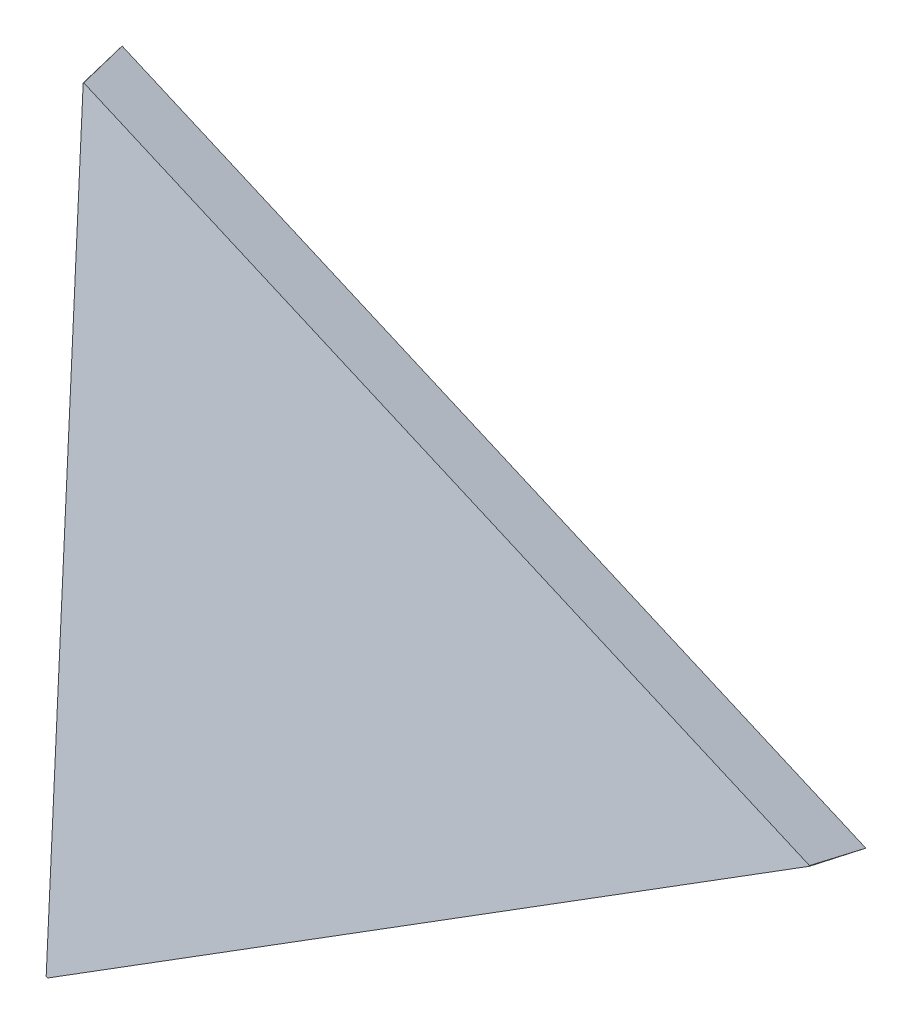
ISO-10303-21;
HEADER;
FILE_DESCRIPTION(('STEP AP214'),'2;1');
FILE_NAME('part.step','',(''),(''),'','','');
FILE_SCHEMA(('AUTOMOTIVE_DESIGN { 1 0 10303 214 1 1 1 1 }'));
ENDSEC;
DATA;
#1=APPLICATION_CONTEXT('core data for automotive mechanical design processes');
#2=APPLICATION_PROTOCOL_DEFINITION('international standard','automotive_design',2000,#1);
#3=PRODUCT_CONTEXT('',#1,'mechanical');
#4=PRODUCT('Part','Part','',(#3));
#5=PRODUCT_RELATED_PRODUCT_CATEGORY('part','',(#4));
#6=PRODUCT_DEFINITION_FORMATION('','',#4);
#7=PRODUCT_DEFINITION_CONTEXT('part definition',#1,'design');
#8=PRODUCT_DEFINITION('design','',#6,#7);
#9=PRODUCT_DEFINITION_SHAPE('','',#8);
#10=(LENGTH_UNIT() NAMED_UNIT(*) SI_UNIT(.MILLI.,.METRE.));
#11=(NAMED_UNIT(*) PLANE_ANGLE_UNIT() SI_UNIT($,.RADIAN.));
#12=(NAMED_UNIT(*) SI_UNIT($,.STERADIAN.) SOLID_ANGLE_UNIT());
#13=UNCERTAINTY_MEASURE_WITH_UNIT(LENGTH_MEASURE(1.E-05),#10,'distance_accuracy_value','');
#14=(GEOMETRIC_REPRESENTATION_CONTEXT(3) GLOBAL_UNCERTAINTY_ASSIGNED_CONTEXT((#13)) GLOBAL_UNIT_ASSIGNED_CONTEXT((#10,
#11,#12)) REPRESENTATION_CONTEXT('',''));
#15=CARTESIAN_POINT('',(0.,0.,0.));
#16=DIRECTION('',(0.,0.,1.));
#17=DIRECTION('',(1.,0.,0.));
#18=AXIS2_PLACEMENT_3D('',#15,#16,#17);
#19=CARTESIAN_POINT('',(240.785783259072,277.952838096614,1293.87547833125));
#20=DIRECTION('',(0.179006841477461,0.206637862725628,0.961902980758687));
#21=DIRECTION('',(0.,-0.977694875536287,0.210030308170238));
#22=AXIS2_PLACEMENT_3D('',#19,#20,#21);
#23=PLANE('',#22);
#24=DIRECTION('',(0.864183938018893,0.434293097596802,-0.254117348187669));
#25=VECTOR('',#24,1.);
#26=CARTESIAN_POINT('',(-1462.86545766845,3454.24262177679,928.582396068232));
#27=LINE('',#26,#25);
#28=CARTESIAN_POINT('',(-5779.68041844186,1284.83995344634,2197.96212205963));
#29=VERTEX_POINT('',#28);
#30=CARTESIAN_POINT('',(-5779.13031938701,1285.11640410923,2197.80036284738));
#31=VERTEX_POINT('',#30);
#32=EDGE_CURVE('E88',#29,#31,#27,.T.);
#33=ORIENTED_EDGE('',*,*,#32,.F.);
#34=DIRECTION('',(0.130760196196566,-0.974018160729322,0.184906445696476));
#35=VECTOR('',#34,1.);
#36=CARTESIAN_POINT('',(-5669.0334551146,460.643027737441,2354.42668322622));
#37=LINE('',#36,#35);
#38=CARTESIAN_POINT('',(-5670.55633935925,471.986823128723,2352.2731906415));
#39=VERTEX_POINT('',#38);
#40=EDGE_CURVE('E98',#29,#39,#37,.T.);
#41=ORIENTED_EDGE('',*,*,#40,.T.);
#42=DIRECTION('',(0.436012225722516,0.859780432736857,-0.265840076932204));
#43=VECTOR('',#42,1.);
#44=CARTESIAN_POINT('',(-4496.83089934924,2786.47735158537,1636.64357554873));
#45=LINE('',#44,#43);
#46=CARTESIAN_POINT('',(-5670.55323323114,471.992948159187,2352.27129681081));
#47=VERTEX_POINT('',#46);
#48=EDGE_CURVE('E130',#39,#47,#45,.T.);
#49=ORIENTED_EDGE('',*,*,#48,.T.);
#50=DIRECTION('',(0.881692532024581,-0.467511697964303,-0.0636481833096339));
#51=VECTOR('',#50,1.);
#52=CARTESIAN_POINT('',(-935.807504560796,-2038.57500454543,2010.47644983516));
#53=LINE('',#52,#51);
#54=CARTESIAN_POINT('',(-5669.32820072082,471.343382673088,2352.18286338518));
#55=VERTEX_POINT('',#54);
#56=EDGE_CURVE('E116',#47,#55,#53,.T.);
#57=ORIENTED_EDGE('',*,*,#56,.T.);
#58=DIRECTION('',(-0.880795564945989,0.469273053704663,0.0631028829624804));
#59=VECTOR('',#58,1.);
#60=CARTESIAN_POINT('',(-945.500561184835,-2045.4324842852,2013.7534314754));
#61=LINE('',#60,#59);
#62=CARTESIAN_POINT('',(-5668.70739686661,471.012628826879,2352.13838710116));
#63=VERTEX_POINT('',#62);
#64=EDGE_CURVE('E126',#63,#55,#61,.T.);
#65=ORIENTED_EDGE('',*,*,#64,.F.);
#66=DIRECTION('',(0.859167694982476,0.443531239580034,-0.255168398151295));
#67=VECTOR('',#66,1.);
#68=CARTESIAN_POINT('',(-4947.27584029813,843.439844637754,2137.876915516));
#69=LINE('',#68,#67);
#70=CARTESIAN_POINT('',(-4951.71690588399,841.147217324302,2139.19588921374));
#71=VERTEX_POINT('',#70);
#72=EDGE_CURVE('E106',#63,#71,#69,.T.);
#73=ORIENTED_EDGE('',*,*,#72,.T.);
#74=DIRECTION('',(-0.141054499481323,0.972984701785518,-0.182768701553136));
#75=VECTOR('',#74,1.);
#76=CARTESIAN_POINT('',(-4792.90261957881,-254.343331138403,2344.97649885625));
#77=LINE('',#76,#75);
#78=CARTESIAN_POINT('',(-4951.80669457761,841.766573853937,2139.07954721113));
#79=VERTEX_POINT('',#78);
#80=EDGE_CURVE('E49',#71,#79,#77,.T.);
#81=ORIENTED_EDGE('',*,*,#80,.T.);
#82=DIRECTION('',(-0.879697754117233,0.47141630949278,0.06243816577466));
#83=VECTOR('',#82,1.);
#84=CARTESIAN_POINT('',(-5789.36503902513,1290.6010307755,2198.52679089432));
#85=LINE('',#84,#83);
#86=EDGE_CURVE('E101',#79,#31,#85,.T.);
#87=ORIENTED_EDGE('',*,*,#86,.T.);
#88=EDGE_LOOP('',(#33,#41,#49,#57,#65,#73,#81,#87));
#89=FACE_BOUND('',#88,.T.);
#90=ADVANCED_FACE('F34',(#89),#23,.T.);
#91=CARTESIAN_POINT('',(-653.184799463512,-1461.79787224728,1833.97695346965));
#92=DIRECTION('',(0.450461984498827,0.868174325788648,-0.208224255462244));
#93=DIRECTION('',(0.879697754117233,-0.47141630949278,-0.06243816577466));
#94=AXIS2_PLACEMENT_3D('',#91,#92,#93);
#95=PLANE('',#94);
#96=DIRECTION('',(-0.29429384467879,-0.0758003858908951,-0.952704274412038));
#97=VECTOR('',#96,1.);
#98=CARTESIAN_POINT('',(-5498.46200447266,1357.4073030272,3106.39532038982));
#99=LINE('',#98,#97);
#100=CARTESIAN_POINT('',(-5800.0498502179,1279.72822308369,2130.07850320796));
#101=VERTEX_POINT('',#100);
#102=EDGE_CURVE('E90',#31,#101,#99,.T.);
#103=ORIENTED_EDGE('',*,*,#102,.F.);
#104=ORIENTED_EDGE('',*,*,#86,.F.);
#105=DIRECTION('',(-0.00633184247303595,-0.230114732743141,-0.973142907051914));
#106=VECTOR('',#105,1.);
#107=CARTESIAN_POINT('',(-4956.87073974541,657.726714152766,1360.7848159349));
#108=LINE('',#107,#106);
#109=CARTESIAN_POINT('',(-4952.25678613157,825.409139496281,2069.90483147783));
#110=VERTEX_POINT('',#109);
#111=EDGE_CURVE('E102',#79,#110,#108,.T.);
#112=ORIENTED_EDGE('',*,*,#111,.T.);
#113=DIRECTION('',(-0.879697754117233,0.47141630949278,0.06243816577466));
#114=VECTOR('',#113,1.);
#115=CARTESIAN_POINT('',(-4952.25678613229,825.409139495862,2069.90483147783));
#116=LINE('',#115,#114);
#117=EDGE_CURVE('E137',#110,#101,#116,.T.);
#118=ORIENTED_EDGE('',*,*,#117,.T.);
#119=EDGE_LOOP('',(#103,#104,#112,#118));
#120=FACE_BOUND('',#119,.T.);
#121=ADVANCED_FACE('F145',(#120),#95,.T.);
#122=CARTESIAN_POINT('',(-1148.0652570678,2804.72003387962,1009.53086104511));
#123=DIRECTION('',(0.494172883844507,-0.84859492246867,0.188891022637911));
#124=DIRECTION('',(-0.859167694982476,-0.443531239580034,0.255168398151295));
#125=AXIS2_PLACEMENT_3D('',#122,#123,#124);
#126=PLANE('',#125);
#127=DIRECTION('',(0.859167694982476,0.443531239580034,-0.255168398151295));
#128=VECTOR('',#127,1.);
#129=CARTESIAN_POINT('',(-5688.06433250319,445.560554591975,2288.43589829003));
#130=LINE('',#129,#128);
#131=CARTESIAN_POINT('',(-5688.06433250319,445.560554591975,2288.43589829003));
#132=VERTEX_POINT('',#131);
#133=EDGE_CURVE('E111',#132,#110,#130,.T.);
#134=ORIENTED_EDGE('',*,*,#133,.T.);
#135=DIRECTION('',(0.0075977481560348,0.221482360827295,0.97513477943581));
#136=VECTOR('',#135,1.);
#137=CARTESIAN_POINT('',(-4956.56259563417,699.890257542947,1517.27469510306));
#138=LINE('',#137,#136);
#139=EDGE_CURVE('E42',#110,#71,#138,.T.);
#140=ORIENTED_EDGE('',*,*,#139,.T.);
#141=ORIENTED_EDGE('',*,*,#72,.F.);
#142=DIRECTION('',(0.271570828069892,0.357083425075242,0.893722950851083));
#143=VECTOR('',#142,1.);
#144=CARTESIAN_POINT('',(-5434.86220986818,778.491310923275,3121.70856535598));
#145=LINE('',#144,#143);
#146=EDGE_CURVE('E109',#132,#63,#145,.T.);
#147=ORIENTED_EDGE('',*,*,#146,.F.);
#148=EDGE_LOOP('',(#134,#140,#141,#147));
#149=FACE_BOUND('',#148,.T.);
#150=ADVANCED_FACE('F121',(#149),#126,.T.);
#151=CARTESIAN_POINT('',(-5570.36051237833,-274.360750119023,2493.95892360576));
#152=DIRECTION('',(-0.953757283896526,-0.0726717228412074,0.291660528892088));
#153=DIRECTION('',(-0.130760196196566,0.974018160729322,-0.184906445696476));
#154=AXIS2_PLACEMENT_3D('',#151,#152,#153);
#155=PLANE('',#154);
#156=DIRECTION('',(0.286659520163632,0.0719375085588469,0.955327857000884));
#157=VECTOR('',#156,1.);
#158=CARTESIAN_POINT('',(-5713.573144122,1301.42964357585,2418.27268656526));
#159=LINE('',#158,#157);
#160=EDGE_CURVE('E11',#101,#29,#159,.T.);
#161=ORIENTED_EDGE('',*,*,#160,.F.);
#162=DIRECTION('',(0.130760196196566,-0.974018160729322,0.184906445696476));
#163=VECTOR('',#162,1.);
#164=CARTESIAN_POINT('',(-5800.0498502179,1279.72822308369,2130.07850320796));
#165=LINE('',#164,#163);
#166=EDGE_CURVE('E140',#101,#132,#165,.T.);
#167=ORIENTED_EDGE('',*,*,#166,.T.);
#168=DIRECTION('',(0.245641196306037,0.370766664340671,0.895651987822855));
#169=VECTOR('',#168,1.);
#170=CARTESIAN_POINT('',(-5701.31245182884,425.564067500102,2240.13087214874));
#171=LINE('',#170,#169);
#172=EDGE_CURVE('E105',#132,#39,#171,.T.);
#173=ORIENTED_EDGE('',*,*,#172,.T.);
#174=ORIENTED_EDGE('',*,*,#40,.F.);
#175=EDGE_LOOP('',(#161,#167,#173,#174));
#176=FACE_BOUND('',#175,.T.);
#177=ADVANCED_FACE('F36',(#176),#155,.T.);
#178=CARTESIAN_POINT('',(228.255304355649,263.48818770582,1226.54226967814));
#179=DIRECTION('',(0.179006841477461,0.206637862725628,0.961902980758687));
#180=DIRECTION('',(0.,-0.977694875536287,0.210030308170238));
#181=AXIS2_PLACEMENT_3D('',#178,#179,#180);
#182=PLANE('',#181);
#183=ORIENTED_EDGE('',*,*,#117,.F.);
#184=ORIENTED_EDGE('',*,*,#133,.F.);
#185=ORIENTED_EDGE('',*,*,#166,.F.);
#186=EDGE_LOOP('',(#183,#184,#185));
#187=FACE_BOUND('',#186,.T.);
#188=ADVANCED_FACE('F143',(#187),#182,.F.);
#189=CARTESIAN_POINT('',(-5692.03346403943,437.516380190714,2292.85599478784));
#190=DIRECTION('',(0.884360531095255,-0.464071838571753,-0.0504358967953565));
#191=DIRECTION('',(0.464663215318139,0.885487490781326,0.));
#192=AXIS2_PLACEMENT_3D('',#189,#190,#191);
#193=PLANE('',#192);
#194=ORIENTED_EDGE('',*,*,#172,.F.);
#195=DIRECTION('',(-0.245695745833152,-0.370877217781088,-0.895591251526304));
#196=VECTOR('',#195,1.);
#197=CARTESIAN_POINT('',(-5688.06433250319,445.560554591953,2288.43589828998));
#198=LINE('',#197,#196);
#199=CARTESIAN_POINT('',(-5670.55212261299,471.995199030949,2352.2700600064));
#200=VERTEX_POINT('',#199);
#201=EDGE_CURVE('E57',#200,#132,#198,.T.);
#202=ORIENTED_EDGE('',*,*,#201,.F.);
#203=DIRECTION('',(0.396913153624833,0.804417440123965,-0.442009649786062));
#204=VECTOR('',#203,1.);
#205=CARTESIAN_POINT('',(-5674.52125414924,463.95102462971,2356.69015650426));
#206=LINE('',#205,#204);
#207=EDGE_CURVE('E128',#47,#200,#206,.T.);
#208=ORIENTED_EDGE('',*,*,#207,.F.);
#209=ORIENTED_EDGE('',*,*,#48,.F.);
#210=EDGE_LOOP('',(#194,#202,#208,#209));
#211=FACE_BOUND('',#210,.T.);
#212=ADVANCED_FACE('F154',(#211),#193,.T.);
#213=CARTESIAN_POINT('',(-5674.52125414924,463.95102462971,2356.69015650426));
#214=DIRECTION('',(-0.2578449134638,-0.364454545224449,-0.894812206592023));
#215=DIRECTION('',(0.,0.926128004667781,-0.377209383459736));
#216=AXIS2_PLACEMENT_3D('',#213,#214,#215);
#217=PLANE('',#216);
#218=ORIENTED_EDGE('',*,*,#207,.T.);
#219=DIRECTION('',(-0.880894970516011,0.469132674719724,0.0627581423395749));
#220=VECTOR('',#219,1.);
#221=CARTESIAN_POINT('',(-5670.55212261299,471.995199030949,2352.2700600064));
#222=LINE('',#221,#220);
#223=EDGE_CURVE('E132',#55,#200,#222,.T.);
#224=ORIENTED_EDGE('',*,*,#223,.F.);
#225=ORIENTED_EDGE('',*,*,#56,.F.);
#226=EDGE_LOOP('',(#218,#224,#225));
#227=FACE_BOUND('',#226,.T.);
#228=ADVANCED_FACE('F155',(#227),#217,.T.);
#229=CARTESIAN_POINT('',(-1155.31957462035,-2341.46741233859,1286.58472490825));
#230=DIRECTION('',(0.396913153624873,0.804417440123944,-0.442009649786064));
#231=DIRECTION('',(0.,0.481567444136679,0.87640903506734));
#232=AXIS2_PLACEMENT_3D('',#229,#230,#231);
#233=PLANE('',#232);
#234=ORIENTED_EDGE('',*,*,#64,.T.);
#235=ORIENTED_EDGE('',*,*,#223,.T.);
#236=ORIENTED_EDGE('',*,*,#201,.T.);
#237=ORIENTED_EDGE('',*,*,#146,.T.);
#238=EDGE_LOOP('',(#234,#235,#236,#237));
#239=FACE_BOUND('',#238,.T.);
#240=ADVANCED_FACE('F150',(#239),#233,.F.);
#241=CARTESIAN_POINT('',(-4820.81155940671,-663.513212632861,188.265036568914));
#242=DIRECTION('',(0.989920206638464,0.136247834718872,-0.0386589190650781));
#243=DIRECTION('',(-0.136349760994211,0.990660760642523,0.));
#244=AXIS2_PLACEMENT_3D('',#241,#242,#243);
#245=PLANE('',#244);
#246=ORIENTED_EDGE('',*,*,#139,.F.);
#247=ORIENTED_EDGE('',*,*,#111,.F.);
#248=ORIENTED_EDGE('',*,*,#80,.F.);
#249=EDGE_LOOP('',(#246,#247,#248));
#250=FACE_BOUND('',#249,.T.);
#251=ADVANCED_FACE('F162',(#250),#245,.T.);
#252=CARTESIAN_POINT('',(-1646.01563059412,3413.92620386689,236.836708654454));
#253=DIRECTION('',(0.433457015180919,-0.899013493475725,-0.0623678967019158));
#254=DIRECTION('',(0.900767081816817,0.434302503233882,0.));
#255=AXIS2_PLACEMENT_3D('',#252,#253,#254);
#256=PLANE('',#255);
#257=ORIENTED_EDGE('',*,*,#32,.T.);
#258=ORIENTED_EDGE('',*,*,#102,.T.);
#259=ORIENTED_EDGE('',*,*,#160,.T.);
#260=EDGE_LOOP('',(#257,#258,#259));
#261=FACE_BOUND('',#260,.T.);
#262=ADVANCED_FACE('F87',(#261),#256,.F.);
#263=CLOSED_SHELL('',(#90,#121,#150,#177,#188,#212,#228,#240,#251,#262));
#264=MANIFOLD_SOLID_BREP('B2',#263);
#265=ADVANCED_BREP_SHAPE_REPRESENTATION('',(#18,#264),#14);
#266=SHAPE_DEFINITION_REPRESENTATION(#9,#265);
ENDSEC;
END-ISO-10303-21;
